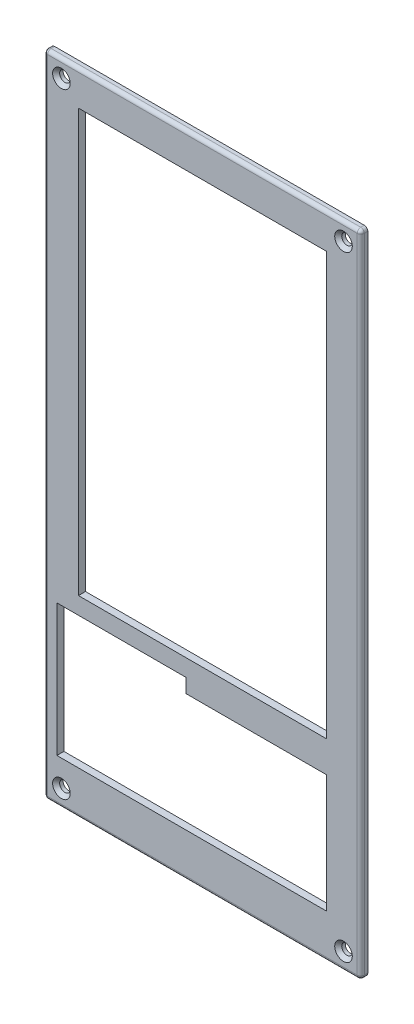
ISO-10303-21;
HEADER;
FILE_DESCRIPTION(('STEP AP214'),'2;1');
FILE_NAME('part.step','',(''),(''),'','','');
FILE_SCHEMA(('AUTOMOTIVE_DESIGN { 1 0 10303 214 1 1 1 1 }'));
ENDSEC;
DATA;
#1=APPLICATION_CONTEXT('core data for automotive mechanical design processes');
#2=APPLICATION_PROTOCOL_DEFINITION('international standard','automotive_design',2000,#1);
#3=PRODUCT_CONTEXT('',#1,'mechanical');
#4=PRODUCT('Part','Part','',(#3));
#5=PRODUCT_RELATED_PRODUCT_CATEGORY('part','',(#4));
#6=PRODUCT_DEFINITION_FORMATION('','',#4);
#7=PRODUCT_DEFINITION_CONTEXT('part definition',#1,'design');
#8=PRODUCT_DEFINITION('design','',#6,#7);
#9=PRODUCT_DEFINITION_SHAPE('','',#8);
#10=(LENGTH_UNIT() NAMED_UNIT(*) SI_UNIT(.MILLI.,.METRE.));
#11=(NAMED_UNIT(*) PLANE_ANGLE_UNIT() SI_UNIT($,.RADIAN.));
#12=(NAMED_UNIT(*) SI_UNIT($,.STERADIAN.) SOLID_ANGLE_UNIT());
#13=UNCERTAINTY_MEASURE_WITH_UNIT(LENGTH_MEASURE(1.E-05),#10,'distance_accuracy_value','');
#14=(GEOMETRIC_REPRESENTATION_CONTEXT(3) GLOBAL_UNCERTAINTY_ASSIGNED_CONTEXT((#13)) GLOBAL_UNIT_ASSIGNED_CONTEXT((#10,
#11,#12)) REPRESENTATION_CONTEXT('',''));
#15=CARTESIAN_POINT('',(0.,0.,0.));
#16=DIRECTION('',(0.,0.,1.));
#17=DIRECTION('',(1.,0.,0.));
#18=AXIS2_PLACEMENT_3D('',#15,#16,#17);
#19=CARTESIAN_POINT('',(0.,-183.6,1.));
#20=DIRECTION('',(-1.,0.,0.));
#21=DIRECTION('',(0.,0.,1.));
#22=AXIS2_PLACEMENT_3D('',#19,#20,#21);
#23=CYLINDRICAL_SURFACE('',#22,1.);
#24=CARTESIAN_POINT('',(89.,-183.6,1.));
#25=DIRECTION('',(1.,0.,0.));
#26=DIRECTION('',(0.,0.,-1.));
#27=AXIS2_PLACEMENT_3D('',#24,#25,#26);
#28=CIRCLE('',#27,1.);
#29=CARTESIAN_POINT('',(89.,-183.6,2.));
#30=VERTEX_POINT('',#29);
#31=CARTESIAN_POINT('',(89.,-184.6,1.));
#32=VERTEX_POINT('',#31);
#33=EDGE_CURVE('E11',#30,#32,#28,.T.);
#34=ORIENTED_EDGE('',*,*,#33,.F.);
#35=DIRECTION('',(1.,0.,0.));
#36=VECTOR('',#35,1.);
#37=CARTESIAN_POINT('',(0.,-183.6,2.));
#38=LINE('',#37,#36);
#39=CARTESIAN_POINT('',(1.00000000000003,-183.6,2.));
#40=VERTEX_POINT('',#39);
#41=EDGE_CURVE('E403',#40,#30,#38,.T.);
#42=ORIENTED_EDGE('',*,*,#41,.F.);
#43=CARTESIAN_POINT('',(1.00000000000002,-183.6,1.));
#44=DIRECTION('',(1.,0.,0.));
#45=DIRECTION('',(0.,1.,0.));
#46=AXIS2_PLACEMENT_3D('',#43,#44,#45);
#47=CIRCLE('',#46,1.);
#48=CARTESIAN_POINT('',(1.00000000000003,-184.6,1.));
#49=VERTEX_POINT('',#48);
#50=EDGE_CURVE('E59',#40,#49,#47,.T.);
#51=ORIENTED_EDGE('',*,*,#50,.T.);
#52=DIRECTION('',(1.,0.,0.));
#53=VECTOR('',#52,1.);
#54=CARTESIAN_POINT('',(0.,-184.6,1.));
#55=LINE('',#54,#53);
#56=EDGE_CURVE('E442',#32,#49,#55,.F.);
#57=ORIENTED_EDGE('',*,*,#56,.F.);
#58=EDGE_LOOP('',(#34,#42,#51,#57));
#59=FACE_BOUND('',#58,.T.);
#60=ADVANCED_FACE('F51',(#59),#23,.T.);
#61=CARTESIAN_POINT('',(1.00000000000002,-183.6,1.));
#62=DIRECTION('',(0.,0.,1.));
#63=DIRECTION('',(1.,0.,0.));
#64=AXIS2_PLACEMENT_3D('',#61,#62,#63);
#65=SPHERICAL_SURFACE('',#64,1.);
#66=ORIENTED_EDGE('',*,*,#50,.F.);
#67=CARTESIAN_POINT('',(1.00000000000002,-183.6,1.));
#68=DIRECTION('',(0.,-1.,0.));
#69=DIRECTION('',(0.,0.,-1.));
#70=AXIS2_PLACEMENT_3D('',#67,#68,#69);
#71=CIRCLE('',#70,1.);
#72=CARTESIAN_POINT('',(0.,-183.6,1.));
#73=VERTEX_POINT('',#72);
#74=EDGE_CURVE('E72',#40,#73,#71,.T.);
#75=ORIENTED_EDGE('',*,*,#74,.T.);
#76=CARTESIAN_POINT('',(1.00000000000002,-183.6,1.));
#77=DIRECTION('',(0.,0.,-1.));
#78=DIRECTION('',(-1.,0.,0.));
#79=AXIS2_PLACEMENT_3D('',#76,#77,#78);
#80=CIRCLE('',#79,1.);
#81=EDGE_CURVE('E439',#49,#73,#80,.T.);
#82=ORIENTED_EDGE('',*,*,#81,.F.);
#83=EDGE_LOOP('',(#66,#75,#82));
#84=FACE_BOUND('',#83,.T.);
#85=ADVANCED_FACE('F516',(#84),#65,.T.);
#86=CARTESIAN_POINT('',(1.,0.,1.));
#87=DIRECTION('',(0.,1.,0.));
#88=DIRECTION('',(-1.,0.,0.));
#89=AXIS2_PLACEMENT_3D('',#86,#87,#88);
#90=CYLINDRICAL_SURFACE('',#89,1.);
#91=ORIENTED_EDGE('',*,*,#74,.F.);
#92=DIRECTION('',(0.,-1.,0.));
#93=VECTOR('',#92,1.);
#94=CARTESIAN_POINT('',(1.,0.,2.));
#95=LINE('',#94,#93);
#96=CARTESIAN_POINT('',(1.,-1.00000000000001,2.));
#97=VERTEX_POINT('',#96);
#98=EDGE_CURVE('E407',#97,#40,#95,.T.);
#99=ORIENTED_EDGE('',*,*,#98,.F.);
#100=CARTESIAN_POINT('',(1.,-1.,1.));
#101=DIRECTION('',(0.,-1.,0.));
#102=DIRECTION('',(1.,0.,0.));
#103=AXIS2_PLACEMENT_3D('',#100,#101,#102);
#104=CIRCLE('',#103,1.);
#105=CARTESIAN_POINT('',(0.,-1.00000000000001,1.));
#106=VERTEX_POINT('',#105);
#107=EDGE_CURVE('E457',#97,#106,#104,.T.);
#108=ORIENTED_EDGE('',*,*,#107,.T.);
#109=DIRECTION('',(0.,-1.,0.));
#110=VECTOR('',#109,1.);
#111=CARTESIAN_POINT('',(0.,0.,1.));
#112=LINE('',#111,#110);
#113=EDGE_CURVE('E435',#73,#106,#112,.F.);
#114=ORIENTED_EDGE('',*,*,#113,.F.);
#115=EDGE_LOOP('',(#91,#99,#108,#114));
#116=FACE_BOUND('',#115,.T.);
#117=ADVANCED_FACE('F521',(#116),#90,.T.);
#118=CARTESIAN_POINT('',(1.,-1.,1.));
#119=DIRECTION('',(0.,0.,1.));
#120=DIRECTION('',(1.,0.,0.));
#121=AXIS2_PLACEMENT_3D('',#118,#119,#120);
#122=SPHERICAL_SURFACE('',#121,1.);
#123=ORIENTED_EDGE('',*,*,#107,.F.);
#124=CARTESIAN_POINT('',(1.00000000000001,-1.,1.));
#125=DIRECTION('',(-1.,0.,0.));
#126=DIRECTION('',(0.,0.,1.));
#127=AXIS2_PLACEMENT_3D('',#124,#125,#126);
#128=CIRCLE('',#127,1.);
#129=CARTESIAN_POINT('',(1.00000000000001,0.,1.));
#130=VERTEX_POINT('',#129);
#131=EDGE_CURVE('E454',#97,#130,#128,.T.);
#132=ORIENTED_EDGE('',*,*,#131,.T.);
#133=CARTESIAN_POINT('',(1.,-1.,1.));
#134=DIRECTION('',(0.,0.,-1.));
#135=DIRECTION('',(-1.,0.,0.));
#136=AXIS2_PLACEMENT_3D('',#133,#134,#135);
#137=CIRCLE('',#136,1.);
#138=EDGE_CURVE('E431',#106,#130,#137,.T.);
#139=ORIENTED_EDGE('',*,*,#138,.F.);
#140=EDGE_LOOP('',(#123,#132,#139));
#141=FACE_BOUND('',#140,.T.);
#142=ADVANCED_FACE('F573',(#141),#122,.T.);
#143=CARTESIAN_POINT('',(0.,-1.,1.));
#144=DIRECTION('',(1.,0.,0.));
#145=DIRECTION('',(0.,0.,-1.));
#146=AXIS2_PLACEMENT_3D('',#143,#144,#145);
#147=CYLINDRICAL_SURFACE('',#146,1.);
#148=ORIENTED_EDGE('',*,*,#131,.F.);
#149=DIRECTION('',(-1.,0.,0.));
#150=VECTOR('',#149,1.);
#151=CARTESIAN_POINT('',(0.,-1.,2.));
#152=LINE('',#151,#150);
#153=CARTESIAN_POINT('',(89.,-1.,2.));
#154=VERTEX_POINT('',#153);
#155=EDGE_CURVE('E411',#154,#97,#152,.T.);
#156=ORIENTED_EDGE('',*,*,#155,.F.);
#157=CARTESIAN_POINT('',(89.,-1.,1.));
#158=DIRECTION('',(-1.,0.,0.));
#159=DIRECTION('',(0.,0.,1.));
#160=AXIS2_PLACEMENT_3D('',#157,#158,#159);
#161=CIRCLE('',#160,1.);
#162=CARTESIAN_POINT('',(89.,0.,1.));
#163=VERTEX_POINT('',#162);
#164=EDGE_CURVE('E451',#154,#163,#161,.T.);
#165=ORIENTED_EDGE('',*,*,#164,.T.);
#166=DIRECTION('',(-1.,0.,0.));
#167=VECTOR('',#166,1.);
#168=CARTESIAN_POINT('',(0.,0.,1.));
#169=LINE('',#168,#167);
#170=EDGE_CURVE('E427',#130,#163,#169,.F.);
#171=ORIENTED_EDGE('',*,*,#170,.F.);
#172=EDGE_LOOP('',(#148,#156,#165,#171));
#173=FACE_BOUND('',#172,.T.);
#174=ADVANCED_FACE('F565',(#173),#147,.T.);
#175=CARTESIAN_POINT('',(89.,-1.,1.));
#176=DIRECTION('',(0.,0.,1.));
#177=DIRECTION('',(1.,0.,0.));
#178=AXIS2_PLACEMENT_3D('',#175,#176,#177);
#179=SPHERICAL_SURFACE('',#178,1.);
#180=ORIENTED_EDGE('',*,*,#164,.F.);
#181=CARTESIAN_POINT('',(89.,-1.00000000000001,1.));
#182=DIRECTION('',(0.,1.,0.));
#183=DIRECTION('',(0.,0.,1.));
#184=AXIS2_PLACEMENT_3D('',#181,#182,#183);
#185=CIRCLE('',#184,1.);
#186=CARTESIAN_POINT('',(90.,-1.00000000000001,1.));
#187=VERTEX_POINT('',#186);
#188=EDGE_CURVE('E448',#154,#187,#185,.T.);
#189=ORIENTED_EDGE('',*,*,#188,.T.);
#190=CARTESIAN_POINT('',(89.,-1.,1.));
#191=DIRECTION('',(0.,0.,-1.));
#192=DIRECTION('',(-1.,0.,0.));
#193=AXIS2_PLACEMENT_3D('',#190,#191,#192);
#194=CIRCLE('',#193,1.);
#195=EDGE_CURVE('E423',#163,#187,#194,.T.);
#196=ORIENTED_EDGE('',*,*,#195,.F.);
#197=EDGE_LOOP('',(#180,#189,#196));
#198=FACE_BOUND('',#197,.T.);
#199=ADVANCED_FACE('F561',(#198),#179,.T.);
#200=CARTESIAN_POINT('',(89.,0.,1.));
#201=DIRECTION('',(0.,-1.,0.));
#202=DIRECTION('',(0.,0.,-1.));
#203=AXIS2_PLACEMENT_3D('',#200,#201,#202);
#204=CYLINDRICAL_SURFACE('',#203,1.);
#205=ORIENTED_EDGE('',*,*,#188,.F.);
#206=DIRECTION('',(0.,1.,0.));
#207=VECTOR('',#206,1.);
#208=CARTESIAN_POINT('',(89.,0.,2.));
#209=LINE('',#208,#207);
#210=EDGE_CURVE('E415',#30,#154,#209,.T.);
#211=ORIENTED_EDGE('',*,*,#210,.F.);
#212=CARTESIAN_POINT('',(89.,-183.6,1.));
#213=DIRECTION('',(0.,1.,0.));
#214=DIRECTION('',(0.,0.,1.));
#215=AXIS2_PLACEMENT_3D('',#212,#213,#214);
#216=CIRCLE('',#215,1.);
#217=CARTESIAN_POINT('',(90.,-183.6,1.));
#218=VERTEX_POINT('',#217);
#219=EDGE_CURVE('E445',#30,#218,#216,.T.);
#220=ORIENTED_EDGE('',*,*,#219,.T.);
#221=DIRECTION('',(0.,1.,0.));
#222=VECTOR('',#221,1.);
#223=CARTESIAN_POINT('',(90.,0.,1.));
#224=LINE('',#223,#222);
#225=EDGE_CURVE('E419',#187,#218,#224,.F.);
#226=ORIENTED_EDGE('',*,*,#225,.F.);
#227=EDGE_LOOP('',(#205,#211,#220,#226));
#228=FACE_BOUND('',#227,.T.);
#229=ADVANCED_FACE('F531',(#228),#204,.T.);
#230=CARTESIAN_POINT('',(89.,-183.6,1.));
#231=DIRECTION('',(0.,0.,1.));
#232=DIRECTION('',(1.,0.,0.));
#233=AXIS2_PLACEMENT_3D('',#230,#231,#232);
#234=SPHERICAL_SURFACE('',#233,1.);
#235=ORIENTED_EDGE('',*,*,#219,.F.);
#236=ORIENTED_EDGE('',*,*,#33,.T.);
#237=CARTESIAN_POINT('',(89.,-183.6,1.));
#238=DIRECTION('',(0.,0.,-1.));
#239=DIRECTION('',(-1.,0.,0.));
#240=AXIS2_PLACEMENT_3D('',#237,#238,#239);
#241=CIRCLE('',#240,1.);
#242=EDGE_CURVE('E399',#218,#32,#241,.T.);
#243=ORIENTED_EDGE('',*,*,#242,.F.);
#244=EDGE_LOOP('',(#235,#236,#243));
#245=FACE_BOUND('',#244,.T.);
#246=ADVANCED_FACE('F526',(#245),#234,.T.);
#247=CARTESIAN_POINT('',(0.,0.,2.));
#248=DIRECTION('',(1.,0.,0.));
#249=DIRECTION('',(0.,1.,0.));
#250=AXIS2_PLACEMENT_3D('',#247,#248,#249);
#251=PLANE('',#250);
#252=DIRECTION('',(0.,0.,-1.));
#253=VECTOR('',#252,1.);
#254=CARTESIAN_POINT('',(0.,-183.6,2.));
#255=LINE('',#254,#253);
#256=CARTESIAN_POINT('',(0.,-183.6,0.));
#257=VERTEX_POINT('',#256);
#258=EDGE_CURVE('E364',#73,#257,#255,.T.);
#259=ORIENTED_EDGE('',*,*,#258,.F.);
#260=ORIENTED_EDGE('',*,*,#113,.T.);
#261=DIRECTION('',(0.,0.,-1.));
#262=VECTOR('',#261,1.);
#263=CARTESIAN_POINT('',(0.,-1.00000000000001,2.));
#264=LINE('',#263,#262);
#265=CARTESIAN_POINT('',(0.,-1.00000000000001,0.));
#266=VERTEX_POINT('',#265);
#267=EDGE_CURVE('E343',#106,#266,#264,.T.);
#268=ORIENTED_EDGE('',*,*,#267,.T.);
#269=DIRECTION('',(0.,-1.,0.));
#270=VECTOR('',#269,1.);
#271=CARTESIAN_POINT('',(0.,0.,0.));
#272=LINE('',#271,#270);
#273=EDGE_CURVE('E307',#266,#257,#272,.T.);
#274=ORIENTED_EDGE('',*,*,#273,.T.);
#275=EDGE_LOOP('',(#259,#260,#268,#274));
#276=FACE_BOUND('',#275,.T.);
#277=ADVANCED_FACE('F539',(#276),#251,.F.);
#278=CARTESIAN_POINT('',(1.00000000000002,-183.6,2.));
#279=DIRECTION('',(0.,0.,-1.));
#280=DIRECTION('',(-1.,0.,0.));
#281=AXIS2_PLACEMENT_3D('',#278,#279,#280);
#282=CYLINDRICAL_SURFACE('',#281,1.);
#283=DIRECTION('',(0.,0.,-1.));
#284=VECTOR('',#283,1.);
#285=CARTESIAN_POINT('',(1.00000000000003,-184.6,2.));
#286=LINE('',#285,#284);
#287=CARTESIAN_POINT('',(1.00000000000003,-184.6,0.));
#288=VERTEX_POINT('',#287);
#289=EDGE_CURVE('E361',#49,#288,#286,.T.);
#290=ORIENTED_EDGE('',*,*,#289,.F.);
#291=ORIENTED_EDGE('',*,*,#81,.T.);
#292=ORIENTED_EDGE('',*,*,#258,.T.);
#293=CARTESIAN_POINT('',(1.00000000000002,-183.6,0.));
#294=DIRECTION('',(0.,0.,1.));
#295=DIRECTION('',(1.,0.,0.));
#296=AXIS2_PLACEMENT_3D('',#293,#294,#295);
#297=CIRCLE('',#296,1.);
#298=EDGE_CURVE('E311',#257,#288,#297,.T.);
#299=ORIENTED_EDGE('',*,*,#298,.T.);
#300=EDGE_LOOP('',(#290,#291,#292,#299));
#301=FACE_BOUND('',#300,.T.);
#302=ADVANCED_FACE('F542',(#301),#282,.T.);
#303=CARTESIAN_POINT('',(0.,-184.6,2.));
#304=DIRECTION('',(0.,1.,0.));
#305=DIRECTION('',(0.,0.,1.));
#306=AXIS2_PLACEMENT_3D('',#303,#304,#305);
#307=PLANE('',#306);
#308=DIRECTION('',(0.,0.,-1.));
#309=VECTOR('',#308,1.);
#310=CARTESIAN_POINT('',(89.,-184.6,2.));
#311=LINE('',#310,#309);
#312=CARTESIAN_POINT('',(89.,-184.6,0.));
#313=VERTEX_POINT('',#312);
#314=EDGE_CURVE('E358',#32,#313,#311,.T.);
#315=ORIENTED_EDGE('',*,*,#314,.F.);
#316=ORIENTED_EDGE('',*,*,#56,.T.);
#317=ORIENTED_EDGE('',*,*,#289,.T.);
#318=DIRECTION('',(1.,0.,0.));
#319=VECTOR('',#318,1.);
#320=CARTESIAN_POINT('',(0.,-184.6,0.));
#321=LINE('',#320,#319);
#322=EDGE_CURVE('E315',#288,#313,#321,.T.);
#323=ORIENTED_EDGE('',*,*,#322,.T.);
#324=EDGE_LOOP('',(#315,#316,#317,#323));
#325=FACE_BOUND('',#324,.T.);
#326=ADVANCED_FACE('F548',(#325),#307,.F.);
#327=CARTESIAN_POINT('',(89.,-183.6,2.));
#328=DIRECTION('',(0.,0.,-1.));
#329=DIRECTION('',(-1.,0.,0.));
#330=AXIS2_PLACEMENT_3D('',#327,#328,#329);
#331=CYLINDRICAL_SURFACE('',#330,1.);
#332=DIRECTION('',(0.,0.,-1.));
#333=VECTOR('',#332,1.);
#334=CARTESIAN_POINT('',(90.,-183.6,2.));
#335=LINE('',#334,#333);
#336=CARTESIAN_POINT('',(90.,-183.6,0.));
#337=VERTEX_POINT('',#336);
#338=EDGE_CURVE('E355',#218,#337,#335,.T.);
#339=ORIENTED_EDGE('',*,*,#338,.F.);
#340=ORIENTED_EDGE('',*,*,#242,.T.);
#341=ORIENTED_EDGE('',*,*,#314,.T.);
#342=CARTESIAN_POINT('',(89.,-183.6,0.));
#343=DIRECTION('',(0.,0.,1.));
#344=DIRECTION('',(1.,0.,0.));
#345=AXIS2_PLACEMENT_3D('',#342,#343,#344);
#346=CIRCLE('',#345,1.);
#347=EDGE_CURVE('E319',#313,#337,#346,.T.);
#348=ORIENTED_EDGE('',*,*,#347,.T.);
#349=EDGE_LOOP('',(#339,#340,#341,#348));
#350=FACE_BOUND('',#349,.T.);
#351=ADVANCED_FACE('F550',(#350),#331,.T.);
#352=CARTESIAN_POINT('',(90.,0.,2.));
#353=DIRECTION('',(-1.,0.,0.));
#354=DIRECTION('',(0.,0.,1.));
#355=AXIS2_PLACEMENT_3D('',#352,#353,#354);
#356=PLANE('',#355);
#357=DIRECTION('',(0.,0.,-1.));
#358=VECTOR('',#357,1.);
#359=CARTESIAN_POINT('',(90.,-1.00000000000001,2.));
#360=LINE('',#359,#358);
#361=CARTESIAN_POINT('',(90.,-1.00000000000001,0.));
#362=VERTEX_POINT('',#361);
#363=EDGE_CURVE('E352',#187,#362,#360,.T.);
#364=ORIENTED_EDGE('',*,*,#363,.F.);
#365=ORIENTED_EDGE('',*,*,#225,.T.);
#366=ORIENTED_EDGE('',*,*,#338,.T.);
#367=DIRECTION('',(0.,1.,0.));
#368=VECTOR('',#367,1.);
#369=CARTESIAN_POINT('',(90.,0.,0.));
#370=LINE('',#369,#368);
#371=EDGE_CURVE('E323',#337,#362,#370,.T.);
#372=ORIENTED_EDGE('',*,*,#371,.T.);
#373=EDGE_LOOP('',(#364,#365,#366,#372));
#374=FACE_BOUND('',#373,.T.);
#375=ADVANCED_FACE('F553',(#374),#356,.F.);
#376=CARTESIAN_POINT('',(89.,-1.,2.));
#377=DIRECTION('',(0.,0.,-1.));
#378=DIRECTION('',(-1.,0.,0.));
#379=AXIS2_PLACEMENT_3D('',#376,#377,#378);
#380=CYLINDRICAL_SURFACE('',#379,1.);
#381=DIRECTION('',(0.,0.,-1.));
#382=VECTOR('',#381,1.);
#383=CARTESIAN_POINT('',(89.,0.,2.));
#384=LINE('',#383,#382);
#385=CARTESIAN_POINT('',(89.,0.,0.));
#386=VERTEX_POINT('',#385);
#387=EDGE_CURVE('E349',#163,#386,#384,.T.);
#388=ORIENTED_EDGE('',*,*,#387,.F.);
#389=ORIENTED_EDGE('',*,*,#195,.T.);
#390=ORIENTED_EDGE('',*,*,#363,.T.);
#391=CARTESIAN_POINT('',(89.,-1.,0.));
#392=DIRECTION('',(0.,0.,1.));
#393=DIRECTION('',(1.,0.,0.));
#394=AXIS2_PLACEMENT_3D('',#391,#392,#393);
#395=CIRCLE('',#394,1.);
#396=EDGE_CURVE('E327',#362,#386,#395,.T.);
#397=ORIENTED_EDGE('',*,*,#396,.T.);
#398=EDGE_LOOP('',(#388,#389,#390,#397));
#399=FACE_BOUND('',#398,.T.);
#400=ADVANCED_FACE('F557',(#399),#380,.T.);
#401=CARTESIAN_POINT('',(0.,0.,2.));
#402=DIRECTION('',(0.,-1.,0.));
#403=DIRECTION('',(0.,0.,-1.));
#404=AXIS2_PLACEMENT_3D('',#401,#402,#403);
#405=PLANE('',#404);
#406=DIRECTION('',(0.,0.,-1.));
#407=VECTOR('',#406,1.);
#408=CARTESIAN_POINT('',(1.00000000000001,0.,2.));
#409=LINE('',#408,#407);
#410=CARTESIAN_POINT('',(1.00000000000001,0.,0.));
#411=VERTEX_POINT('',#410);
#412=EDGE_CURVE('E346',#130,#411,#409,.T.);
#413=ORIENTED_EDGE('',*,*,#412,.F.);
#414=ORIENTED_EDGE('',*,*,#170,.T.);
#415=ORIENTED_EDGE('',*,*,#387,.T.);
#416=DIRECTION('',(-1.,0.,0.));
#417=VECTOR('',#416,1.);
#418=CARTESIAN_POINT('',(0.,0.,0.));
#419=LINE('',#418,#417);
#420=EDGE_CURVE('E331',#386,#411,#419,.T.);
#421=ORIENTED_EDGE('',*,*,#420,.T.);
#422=EDGE_LOOP('',(#413,#414,#415,#421));
#423=FACE_BOUND('',#422,.T.);
#424=ADVANCED_FACE('F568',(#423),#405,.F.);
#425=CARTESIAN_POINT('',(1.,-1.,2.));
#426=DIRECTION('',(0.,0.,-1.));
#427=DIRECTION('',(-1.,0.,0.));
#428=AXIS2_PLACEMENT_3D('',#425,#426,#427);
#429=CYLINDRICAL_SURFACE('',#428,1.);
#430=ORIENTED_EDGE('',*,*,#267,.F.);
#431=ORIENTED_EDGE('',*,*,#138,.T.);
#432=ORIENTED_EDGE('',*,*,#412,.T.);
#433=CARTESIAN_POINT('',(1.,-1.,0.));
#434=DIRECTION('',(0.,0.,1.));
#435=DIRECTION('',(1.,0.,0.));
#436=AXIS2_PLACEMENT_3D('',#433,#434,#435);
#437=CIRCLE('',#436,1.);
#438=EDGE_CURVE('E335',#266,#411,#437,.F.);
#439=ORIENTED_EDGE('',*,*,#438,.F.);
#440=EDGE_LOOP('',(#430,#431,#432,#439));
#441=FACE_BOUND('',#440,.T.);
#442=ADVANCED_FACE('F571',(#441),#429,.T.);
#443=CARTESIAN_POINT('',(4.90640059568512,-179.693599404313,2.));
#444=DIRECTION('',(0.,0.,-1.));
#445=DIRECTION('',(-1.,0.,0.));
#446=AXIS2_PLACEMENT_3D('',#443,#444,#445);
#447=CYLINDRICAL_SURFACE('',#446,1.5);
#448=CARTESIAN_POINT('',(4.90640059568512,-179.693599404313,1.00000000000002));
#449=DIRECTION('',(0.,0.,1.));
#450=DIRECTION('',(1.,0.,0.));
#451=AXIS2_PLACEMENT_3D('',#448,#449,#450);
#452=CIRCLE('',#451,1.5);
#453=CARTESIAN_POINT('',(6.40640059568511,-179.693599404313,1.00000000000002));
#454=VERTEX_POINT('',#453);
#455=EDGE_CURVE('E391',#454,#454,#452,.T.);
#456=ORIENTED_EDGE('',*,*,#455,.T.);
#457=EDGE_LOOP('',(#456));
#458=FACE_BOUND('',#457,.T.);
#459=CARTESIAN_POINT('',(4.90640059568512,-179.693599404313,0.));
#460=DIRECTION('',(0.,0.,1.));
#461=DIRECTION('',(1.,0.,0.));
#462=AXIS2_PLACEMENT_3D('',#459,#460,#461);
#463=CIRCLE('',#462,1.5);
#464=CARTESIAN_POINT('',(6.40640059568511,-179.693599404313,0.));
#465=VERTEX_POINT('',#464);
#466=EDGE_CURVE('E303',#465,#465,#463,.T.);
#467=ORIENTED_EDGE('',*,*,#466,.F.);
#468=EDGE_LOOP('',(#467));
#469=FACE_BOUND('',#468,.T.);
#470=ADVANCED_FACE('F618',(#458,#469),#447,.F.);
#471=CARTESIAN_POINT('',(4.90640059568512,-4.90640059568656,2.));
#472=DIRECTION('',(0.,0.,-1.));
#473=DIRECTION('',(-1.,0.,0.));
#474=AXIS2_PLACEMENT_3D('',#471,#472,#473);
#475=CYLINDRICAL_SURFACE('',#474,1.5);
#476=CARTESIAN_POINT('',(4.90640059568512,-4.90640059568656,0.999999999999982));
#477=DIRECTION('',(0.,0.,1.));
#478=DIRECTION('',(1.,0.,0.));
#479=AXIS2_PLACEMENT_3D('',#476,#477,#478);
#480=CIRCLE('',#479,1.5);
#481=CARTESIAN_POINT('',(6.40640059568511,-4.90640059568656,0.999999999999982));
#482=VERTEX_POINT('',#481);
#483=EDGE_CURVE('E395',#482,#482,#480,.T.);
#484=ORIENTED_EDGE('',*,*,#483,.T.);
#485=EDGE_LOOP('',(#484));
#486=FACE_BOUND('',#485,.T.);
#487=CARTESIAN_POINT('',(4.90640059568512,-4.90640059568656,0.));
#488=DIRECTION('',(0.,0.,1.));
#489=DIRECTION('',(1.,0.,0.));
#490=AXIS2_PLACEMENT_3D('',#487,#488,#489);
#491=CIRCLE('',#490,1.5);
#492=CARTESIAN_POINT('',(6.40640059568511,-4.90640059568656,0.));
#493=VERTEX_POINT('',#492);
#494=EDGE_CURVE('E299',#493,#493,#491,.F.);
#495=ORIENTED_EDGE('',*,*,#494,.T.);
#496=EDGE_LOOP('',(#495));
#497=FACE_BOUND('',#496,.T.);
#498=ADVANCED_FACE('F511',(#486,#497),#475,.F.);
#499=CARTESIAN_POINT('',(85.0935994043149,-4.90640059568662,2.));
#500=DIRECTION('',(0.,0.,-1.));
#501=DIRECTION('',(-1.,0.,0.));
#502=AXIS2_PLACEMENT_3D('',#499,#500,#501);
#503=CYLINDRICAL_SURFACE('',#502,1.5);
#504=CARTESIAN_POINT('',(85.0935994043149,-4.90640059568662,0.99999999999999));
#505=DIRECTION('',(0.,0.,1.));
#506=DIRECTION('',(1.,0.,0.));
#507=AXIS2_PLACEMENT_3D('',#504,#505,#506);
#508=CIRCLE('',#507,1.5);
#509=CARTESIAN_POINT('',(86.5935994043149,-4.90640059568662,0.99999999999999));
#510=VERTEX_POINT('',#509);
#511=EDGE_CURVE('E367',#510,#510,#508,.T.);
#512=ORIENTED_EDGE('',*,*,#511,.T.);
#513=EDGE_LOOP('',(#512));
#514=FACE_BOUND('',#513,.T.);
#515=CARTESIAN_POINT('',(85.0935994043149,-4.90640059568662,0.));
#516=DIRECTION('',(0.,0.,1.));
#517=DIRECTION('',(1.,0.,0.));
#518=AXIS2_PLACEMENT_3D('',#515,#516,#517);
#519=CIRCLE('',#518,1.5);
#520=CARTESIAN_POINT('',(86.5935994043149,-4.90640059568662,0.));
#521=VERTEX_POINT('',#520);
#522=EDGE_CURVE('E233',#521,#521,#519,.T.);
#523=ORIENTED_EDGE('',*,*,#522,.F.);
#524=EDGE_LOOP('',(#523));
#525=FACE_BOUND('',#524,.T.);
#526=ADVANCED_FACE('F501',(#514,#525),#503,.F.);
#527=CARTESIAN_POINT('',(85.0935994043149,-179.693599404313,2.));
#528=DIRECTION('',(0.,0.,-1.));
#529=DIRECTION('',(-1.,0.,0.));
#530=AXIS2_PLACEMENT_3D('',#527,#528,#529);
#531=CYLINDRICAL_SURFACE('',#530,1.5);
#532=CARTESIAN_POINT('',(85.0935994043149,-179.693599404313,0.99999999999999));
#533=DIRECTION('',(0.,0.,1.));
#534=DIRECTION('',(1.,0.,0.));
#535=AXIS2_PLACEMENT_3D('',#532,#533,#534);
#536=CIRCLE('',#535,1.5);
#537=CARTESIAN_POINT('',(86.5935994043149,-179.693599404313,0.99999999999999));
#538=VERTEX_POINT('',#537);
#539=EDGE_CURVE('E387',#538,#538,#536,.T.);
#540=ORIENTED_EDGE('',*,*,#539,.T.);
#541=EDGE_LOOP('',(#540));
#542=FACE_BOUND('',#541,.T.);
#543=CARTESIAN_POINT('',(85.0935994043149,-179.693599404313,0.));
#544=DIRECTION('',(0.,0.,1.));
#545=DIRECTION('',(1.,0.,0.));
#546=AXIS2_PLACEMENT_3D('',#543,#544,#545);
#547=CIRCLE('',#546,1.5);
#548=CARTESIAN_POINT('',(86.5935994043149,-179.693599404313,0.));
#549=VERTEX_POINT('',#548);
#550=EDGE_CURVE('E339',#549,#549,#547,.F.);
#551=ORIENTED_EDGE('',*,*,#550,.T.);
#552=EDGE_LOOP('',(#551));
#553=FACE_BOUND('',#552,.T.);
#554=ADVANCED_FACE('F499',(#542,#553),#531,.F.);
#555=CARTESIAN_POINT('',(0.,0.,2.));
#556=DIRECTION('',(0.,0.,1.));
#557=DIRECTION('',(1.,0.,0.));
#558=AXIS2_PLACEMENT_3D('',#555,#556,#557);
#559=PLANE('',#558);
#560=ORIENTED_EDGE('',*,*,#41,.T.);
#561=ORIENTED_EDGE('',*,*,#210,.T.);
#562=ORIENTED_EDGE('',*,*,#155,.T.);
#563=ORIENTED_EDGE('',*,*,#98,.T.);
#564=EDGE_LOOP('',(#560,#561,#562,#563));
#565=FACE_BOUND('',#564,.T.);
#566=DIRECTION('',(0.,-1.,0.));
#567=VECTOR('',#566,1.);
#568=CARTESIAN_POINT('',(9.75774957468557,-9.79836629832936,2.));
#569=LINE('',#568,#567);
#570=CARTESIAN_POINT('',(9.75774957468557,-9.79836629832936,2.));
#571=VERTEX_POINT('',#570);
#572=CARTESIAN_POINT('',(9.75774957468558,-129.798366298329,2.));
#573=VERTEX_POINT('',#572);
#574=EDGE_CURVE('E211',#571,#573,#569,.T.);
#575=ORIENTED_EDGE('',*,*,#574,.F.);
#576=DIRECTION('',(-1.,0.,0.));
#577=VECTOR('',#576,1.);
#578=CARTESIAN_POINT('',(9.75774957468557,-9.79836629832936,2.));
#579=LINE('',#578,#577);
#580=CARTESIAN_POINT('',(80.2422504253145,-9.79836629832936,2.));
#581=VERTEX_POINT('',#580);
#582=EDGE_CURVE('E216',#581,#571,#579,.T.);
#583=ORIENTED_EDGE('',*,*,#582,.F.);
#584=DIRECTION('',(0.,1.,0.));
#585=VECTOR('',#584,1.);
#586=CARTESIAN_POINT('',(80.2422504253145,-9.79836629832936,2.));
#587=LINE('',#586,#585);
#588=CARTESIAN_POINT('',(80.2422504253145,-129.798366298329,2.));
#589=VERTEX_POINT('',#588);
#590=EDGE_CURVE('E193',#589,#581,#587,.T.);
#591=ORIENTED_EDGE('',*,*,#590,.F.);
#592=DIRECTION('',(1.,0.,0.));
#593=VECTOR('',#592,1.);
#594=CARTESIAN_POINT('',(80.2422504253145,-129.798366298329,2.));
#595=LINE('',#594,#593);
#596=EDGE_CURVE('E205',#573,#589,#595,.T.);
#597=ORIENTED_EDGE('',*,*,#596,.F.);
#598=EDGE_LOOP('',(#575,#583,#591,#597));
#599=FACE_BOUND('',#598,.T.);
#600=DIRECTION('',(0.,1.,0.));
#601=VECTOR('',#600,1.);
#602=CARTESIAN_POINT('',(80.2422504253145,-172.224363873103,2.));
#603=LINE('',#602,#601);
#604=CARTESIAN_POINT('',(80.2422504253145,-172.224363873103,2.));
#605=VERTEX_POINT('',#604);
#606=CARTESIAN_POINT('',(80.2422504253145,-138.653704662281,2.));
#607=VERTEX_POINT('',#606);
#608=EDGE_CURVE('E279',#605,#607,#603,.T.);
#609=ORIENTED_EDGE('',*,*,#608,.F.);
#610=DIRECTION('',(1.,0.,0.));
#611=VECTOR('',#610,1.);
#612=CARTESIAN_POINT('',(3.61620761531452,-172.224363873103,2.));
#613=LINE('',#612,#611);
#614=CARTESIAN_POINT('',(3.61620761531452,-172.224363873103,2.));
#615=VERTEX_POINT('',#614);
#616=EDGE_CURVE('E243',#615,#605,#613,.T.);
#617=ORIENTED_EDGE('',*,*,#616,.F.);
#618=DIRECTION('',(0.,-1.,0.));
#619=VECTOR('',#618,1.);
#620=CARTESIAN_POINT('',(3.61620761531452,-134.653704662281,2.));
#621=LINE('',#620,#619);
#622=CARTESIAN_POINT('',(3.61620761531452,-134.653704662281,2.));
#623=VERTEX_POINT('',#622);
#624=EDGE_CURVE('E263',#623,#615,#621,.T.);
#625=ORIENTED_EDGE('',*,*,#624,.F.);
#626=DIRECTION('',(-1.,0.,0.));
#627=VECTOR('',#626,1.);
#628=CARTESIAN_POINT('',(40.3170462765684,-134.653704662281,2.));
#629=LINE('',#628,#627);
#630=CARTESIAN_POINT('',(40.3170462765684,-134.653704662281,2.));
#631=VERTEX_POINT('',#630);
#632=EDGE_CURVE('E267',#631,#623,#629,.T.);
#633=ORIENTED_EDGE('',*,*,#632,.F.);
#634=DIRECTION('',(0.,1.,0.));
#635=VECTOR('',#634,1.);
#636=CARTESIAN_POINT('',(40.3170462765684,-138.653704662281,2.));
#637=LINE('',#636,#635);
#638=CARTESIAN_POINT('',(40.3170462765684,-138.653704662281,2.));
#639=VERTEX_POINT('',#638);
#640=EDGE_CURVE('E271',#639,#631,#637,.T.);
#641=ORIENTED_EDGE('',*,*,#640,.F.);
#642=DIRECTION('',(-1.,0.,0.));
#643=VECTOR('',#642,1.);
#644=CARTESIAN_POINT('',(80.2422504253145,-138.653704662281,2.));
#645=LINE('',#644,#643);
#646=EDGE_CURVE('E275',#607,#639,#645,.T.);
#647=ORIENTED_EDGE('',*,*,#646,.F.);
#648=EDGE_LOOP('',(#609,#617,#625,#633,#641,#647));
#649=FACE_BOUND('',#648,.T.);
#650=CARTESIAN_POINT('',(85.0935994043149,-4.90640059568662,2.));
#651=DIRECTION('',(0.,0.,1.));
#652=DIRECTION('',(1.,0.,0.));
#653=AXIS2_PLACEMENT_3D('',#650,#651,#652);
#654=CIRCLE('',#653,2.50000000000003);
#655=CARTESIAN_POINT('',(87.5935994043149,-4.90640059568662,2.));
#656=VERTEX_POINT('',#655);
#657=EDGE_CURVE('E383',#656,#656,#654,.F.);
#658=ORIENTED_EDGE('',*,*,#657,.T.);
#659=EDGE_LOOP('',(#658));
#660=FACE_BOUND('',#659,.T.);
#661=CARTESIAN_POINT('',(85.0935994043149,-179.693599404313,2.));
#662=DIRECTION('',(0.,0.,1.));
#663=DIRECTION('',(1.,0.,0.));
#664=AXIS2_PLACEMENT_3D('',#661,#662,#663);
#665=CIRCLE('',#664,2.49999999999997);
#666=CARTESIAN_POINT('',(87.5935994043149,-179.693599404313,2.));
#667=VERTEX_POINT('',#666);
#668=EDGE_CURVE('E379',#667,#667,#665,.F.);
#669=ORIENTED_EDGE('',*,*,#668,.T.);
#670=EDGE_LOOP('',(#669));
#671=FACE_BOUND('',#670,.T.);
#672=CARTESIAN_POINT('',(4.90640059568512,-179.693599404313,2.));
#673=DIRECTION('',(0.,0.,1.));
#674=DIRECTION('',(1.,0.,0.));
#675=AXIS2_PLACEMENT_3D('',#672,#673,#674);
#676=CIRCLE('',#675,2.49999999999997);
#677=CARTESIAN_POINT('',(7.40640059568509,-179.693599404313,2.));
#678=VERTEX_POINT('',#677);
#679=EDGE_CURVE('E375',#678,#678,#676,.F.);
#680=ORIENTED_EDGE('',*,*,#679,.T.);
#681=EDGE_LOOP('',(#680));
#682=FACE_BOUND('',#681,.T.);
#683=CARTESIAN_POINT('',(4.90640059568512,-4.90640059568656,2.));
#684=DIRECTION('',(0.,0.,1.));
#685=DIRECTION('',(1.,0.,0.));
#686=AXIS2_PLACEMENT_3D('',#683,#684,#685);
#687=CIRCLE('',#686,2.5);
#688=CARTESIAN_POINT('',(7.40640059568512,-4.90640059568656,2.));
#689=VERTEX_POINT('',#688);
#690=EDGE_CURVE('E371',#689,#689,#687,.F.);
#691=ORIENTED_EDGE('',*,*,#690,.T.);
#692=EDGE_LOOP('',(#691));
#693=FACE_BOUND('',#692,.T.);
#694=ADVANCED_FACE('F213',(#565,#599,#649,#660,#671,#682,#693),#559,.T.);
#695=CARTESIAN_POINT('',(0.,0.,0.));
#696=DIRECTION('',(0.,0.,1.));
#697=DIRECTION('',(1.,0.,0.));
#698=AXIS2_PLACEMENT_3D('',#695,#696,#697);
#699=PLANE('',#698);
#700=DIRECTION('',(1.,0.,0.));
#701=VECTOR('',#700,1.);
#702=CARTESIAN_POINT('',(9.75774957468557,-9.79836629832936,0.));
#703=LINE('',#702,#701);
#704=CARTESIAN_POINT('',(9.75774957468557,-9.79836629832936,0.));
#705=VERTEX_POINT('',#704);
#706=CARTESIAN_POINT('',(80.2422504253145,-9.79836629832936,0.));
#707=VERTEX_POINT('',#706);
#708=EDGE_CURVE('E464',#705,#707,#703,.T.);
#709=ORIENTED_EDGE('',*,*,#708,.F.);
#710=DIRECTION('',(0.,1.,0.));
#711=VECTOR('',#710,1.);
#712=CARTESIAN_POINT('',(9.75774957468557,-9.79836629832936,0.));
#713=LINE('',#712,#711);
#714=CARTESIAN_POINT('',(9.75774957468559,-129.798366298329,0.));
#715=VERTEX_POINT('',#714);
#716=EDGE_CURVE('E234',#715,#705,#713,.T.);
#717=ORIENTED_EDGE('',*,*,#716,.F.);
#718=DIRECTION('',(-1.,0.,0.));
#719=VECTOR('',#718,1.);
#720=CARTESIAN_POINT('',(80.2422504253145,-129.798366298329,0.));
#721=LINE('',#720,#719);
#722=CARTESIAN_POINT('',(80.2422504253145,-129.798366298329,0.));
#723=VERTEX_POINT('',#722);
#724=EDGE_CURVE('E230',#723,#715,#721,.T.);
#725=ORIENTED_EDGE('',*,*,#724,.F.);
#726=DIRECTION('',(0.,-1.,0.));
#727=VECTOR('',#726,1.);
#728=CARTESIAN_POINT('',(80.2422504253145,-9.79836629832936,0.));
#729=LINE('',#728,#727);
#730=EDGE_CURVE('E196',#707,#723,#729,.T.);
#731=ORIENTED_EDGE('',*,*,#730,.F.);
#732=EDGE_LOOP('',(#709,#717,#725,#731));
#733=FACE_BOUND('',#732,.T.);
#734=DIRECTION('',(-1.,0.,0.));
#735=VECTOR('',#734,1.);
#736=CARTESIAN_POINT('',(3.61620761531452,-172.224363873103,0.));
#737=LINE('',#736,#735);
#738=CARTESIAN_POINT('',(80.2422504253145,-172.224363873103,0.));
#739=VERTEX_POINT('',#738);
#740=CARTESIAN_POINT('',(3.61620761531452,-172.224363873103,0.));
#741=VERTEX_POINT('',#740);
#742=EDGE_CURVE('E284',#739,#741,#737,.T.);
#743=ORIENTED_EDGE('',*,*,#742,.F.);
#744=DIRECTION('',(0.,-1.,0.));
#745=VECTOR('',#744,1.);
#746=CARTESIAN_POINT('',(80.2422504253145,-172.224363873103,0.));
#747=LINE('',#746,#745);
#748=CARTESIAN_POINT('',(80.2422504253145,-138.653704662281,0.));
#749=VERTEX_POINT('',#748);
#750=EDGE_CURVE('E238',#749,#739,#747,.T.);
#751=ORIENTED_EDGE('',*,*,#750,.F.);
#752=DIRECTION('',(1.,0.,0.));
#753=VECTOR('',#752,1.);
#754=CARTESIAN_POINT('',(80.2422504253145,-138.653704662281,0.));
#755=LINE('',#754,#753);
#756=CARTESIAN_POINT('',(40.3170462765684,-138.653704662281,0.));
#757=VERTEX_POINT('',#756);
#758=EDGE_CURVE('E235',#757,#749,#755,.T.);
#759=ORIENTED_EDGE('',*,*,#758,.F.);
#760=DIRECTION('',(0.,-1.,0.));
#761=VECTOR('',#760,1.);
#762=CARTESIAN_POINT('',(40.3170462765684,-138.653704662281,0.));
#763=LINE('',#762,#761);
#764=CARTESIAN_POINT('',(40.3170462765684,-134.653704662281,0.));
#765=VERTEX_POINT('',#764);
#766=EDGE_CURVE('E259',#765,#757,#763,.T.);
#767=ORIENTED_EDGE('',*,*,#766,.F.);
#768=DIRECTION('',(1.,0.,0.));
#769=VECTOR('',#768,1.);
#770=CARTESIAN_POINT('',(40.3170462765684,-134.653704662281,0.));
#771=LINE('',#770,#769);
#772=CARTESIAN_POINT('',(3.61620761531452,-134.653704662281,0.));
#773=VERTEX_POINT('',#772);
#774=EDGE_CURVE('E290',#773,#765,#771,.T.);
#775=ORIENTED_EDGE('',*,*,#774,.F.);
#776=DIRECTION('',(0.,1.,0.));
#777=VECTOR('',#776,1.);
#778=CARTESIAN_POINT('',(3.61620761531452,-134.653704662281,0.));
#779=LINE('',#778,#777);
#780=EDGE_CURVE('E287',#741,#773,#779,.T.);
#781=ORIENTED_EDGE('',*,*,#780,.F.);
#782=EDGE_LOOP('',(#743,#751,#759,#767,#775,#781));
#783=FACE_BOUND('',#782,.T.);
#784=ORIENTED_EDGE('',*,*,#522,.T.);
#785=EDGE_LOOP('',(#784));
#786=FACE_BOUND('',#785,.T.);
#787=ORIENTED_EDGE('',*,*,#494,.F.);
#788=EDGE_LOOP('',(#787));
#789=FACE_BOUND('',#788,.T.);
#790=ORIENTED_EDGE('',*,*,#466,.T.);
#791=EDGE_LOOP('',(#790));
#792=FACE_BOUND('',#791,.T.);
#793=ORIENTED_EDGE('',*,*,#273,.F.);
#794=ORIENTED_EDGE('',*,*,#438,.T.);
#795=ORIENTED_EDGE('',*,*,#420,.F.);
#796=ORIENTED_EDGE('',*,*,#396,.F.);
#797=ORIENTED_EDGE('',*,*,#371,.F.);
#798=ORIENTED_EDGE('',*,*,#347,.F.);
#799=ORIENTED_EDGE('',*,*,#322,.F.);
#800=ORIENTED_EDGE('',*,*,#298,.F.);
#801=EDGE_LOOP('',(#793,#794,#795,#796,#797,#798,#799,#800));
#802=FACE_BOUND('',#801,.T.);
#803=ORIENTED_EDGE('',*,*,#550,.F.);
#804=EDGE_LOOP('',(#803));
#805=FACE_BOUND('',#804,.T.);
#806=ADVANCED_FACE('F478',(#733,#783,#786,#789,#792,#802,#805),#699,.F.);
#807=CARTESIAN_POINT('',(85.0935994043149,-4.90640059568662,0.99999999999999));
#808=DIRECTION('',(0.,0.,1.));
#809=DIRECTION('',(1.,0.,0.));
#810=AXIS2_PLACEMENT_3D('',#807,#808,#809);
#811=CONICAL_SURFACE('',#810,1.5,0.785398163397459);
#812=ORIENTED_EDGE('',*,*,#657,.F.);
#813=EDGE_LOOP('',(#812));
#814=FACE_BOUND('',#813,.T.);
#815=ORIENTED_EDGE('',*,*,#511,.F.);
#816=EDGE_LOOP('',(#815));
#817=FACE_BOUND('',#816,.T.);
#818=ADVANCED_FACE('F481',(#814,#817),#811,.F.);
#819=CARTESIAN_POINT('',(85.0935994043149,-179.693599404313,2.));
#820=DIRECTION('',(0.,0.,1.));
#821=DIRECTION('',(1.,0.,0.));
#822=AXIS2_PLACEMENT_3D('',#819,#820,#821);
#823=CONICAL_SURFACE('',#822,2.49999999999997,0.785398163397432);
#824=ORIENTED_EDGE('',*,*,#539,.F.);
#825=EDGE_LOOP('',(#824));
#826=FACE_BOUND('',#825,.T.);
#827=ORIENTED_EDGE('',*,*,#668,.F.);
#828=EDGE_LOOP('',(#827));
#829=FACE_BOUND('',#828,.T.);
#830=ADVANCED_FACE('F604',(#826,#829),#823,.F.);
#831=CARTESIAN_POINT('',(4.90640059568512,-179.693599404313,1.00000000000002));
#832=DIRECTION('',(0.,0.,1.));
#833=DIRECTION('',(1.,0.,0.));
#834=AXIS2_PLACEMENT_3D('',#831,#832,#833);
#835=CONICAL_SURFACE('',#834,1.5,0.785398163397446);
#836=ORIENTED_EDGE('',*,*,#679,.F.);
#837=EDGE_LOOP('',(#836));
#838=FACE_BOUND('',#837,.T.);
#839=ORIENTED_EDGE('',*,*,#455,.F.);
#840=EDGE_LOOP('',(#839));
#841=FACE_BOUND('',#840,.T.);
#842=ADVANCED_FACE('F597',(#838,#841),#835,.F.);
#843=CARTESIAN_POINT('',(4.90640059568512,-4.90640059568656,2.));
#844=DIRECTION('',(0.,0.,1.));
#845=DIRECTION('',(1.,0.,0.));
#846=AXIS2_PLACEMENT_3D('',#843,#844,#845);
#847=CONICAL_SURFACE('',#846,2.5,0.785398163397443);
#848=ORIENTED_EDGE('',*,*,#483,.F.);
#849=EDGE_LOOP('',(#848));
#850=FACE_BOUND('',#849,.T.);
#851=ORIENTED_EDGE('',*,*,#690,.F.);
#852=EDGE_LOOP('',(#851));
#853=FACE_BOUND('',#852,.T.);
#854=ADVANCED_FACE('F590',(#850,#853),#847,.F.);
#855=CARTESIAN_POINT('',(80.2422504253145,-172.224363873103,-139.169195083403));
#856=DIRECTION('',(1.,0.,0.));
#857=DIRECTION('',(0.,0.,-1.));
#858=AXIS2_PLACEMENT_3D('',#855,#856,#857);
#859=PLANE('',#858);
#860=ORIENTED_EDGE('',*,*,#750,.T.);
#861=DIRECTION('',(0.,0.,1.));
#862=VECTOR('',#861,1.);
#863=CARTESIAN_POINT('',(80.2422504253145,-172.224363873103,-139.169195083403));
#864=LINE('',#863,#862);
#865=EDGE_CURVE('E256',#739,#605,#864,.T.);
#866=ORIENTED_EDGE('',*,*,#865,.T.);
#867=ORIENTED_EDGE('',*,*,#608,.T.);
#868=DIRECTION('',(0.,0.,1.));
#869=VECTOR('',#868,1.);
#870=CARTESIAN_POINT('',(80.2422504253145,-138.653704662281,-139.169195083403));
#871=LINE('',#870,#869);
#872=EDGE_CURVE('E239',#749,#607,#871,.T.);
#873=ORIENTED_EDGE('',*,*,#872,.F.);
#874=EDGE_LOOP('',(#860,#866,#867,#873));
#875=FACE_BOUND('',#874,.T.);
#876=ADVANCED_FACE('F596',(#875),#859,.F.);
#877=CARTESIAN_POINT('',(3.61620761531452,-172.224363873103,-139.169195083403));
#878=DIRECTION('',(0.,-1.,0.));
#879=DIRECTION('',(0.,0.,-1.));
#880=AXIS2_PLACEMENT_3D('',#877,#878,#879);
#881=PLANE('',#880);
#882=ORIENTED_EDGE('',*,*,#742,.T.);
#883=DIRECTION('',(0.,0.,1.));
#884=VECTOR('',#883,1.);
#885=CARTESIAN_POINT('',(3.61620761531452,-172.224363873103,-139.169195083403));
#886=LINE('',#885,#884);
#887=EDGE_CURVE('E253',#741,#615,#886,.T.);
#888=ORIENTED_EDGE('',*,*,#887,.T.);
#889=ORIENTED_EDGE('',*,*,#616,.T.);
#890=ORIENTED_EDGE('',*,*,#865,.F.);
#891=EDGE_LOOP('',(#882,#888,#889,#890));
#892=FACE_BOUND('',#891,.T.);
#893=ADVANCED_FACE('F692',(#892),#881,.F.);
#894=CARTESIAN_POINT('',(3.61620761531452,-134.653704662281,-139.169195083403));
#895=DIRECTION('',(-1.,0.,0.));
#896=DIRECTION('',(0.,-1.,0.));
#897=AXIS2_PLACEMENT_3D('',#894,#895,#896);
#898=PLANE('',#897);
#899=ORIENTED_EDGE('',*,*,#780,.T.);
#900=DIRECTION('',(0.,0.,1.));
#901=VECTOR('',#900,1.);
#902=CARTESIAN_POINT('',(3.61620761531452,-134.653704662281,-139.169195083403));
#903=LINE('',#902,#901);
#904=EDGE_CURVE('E250',#773,#623,#903,.T.);
#905=ORIENTED_EDGE('',*,*,#904,.T.);
#906=ORIENTED_EDGE('',*,*,#624,.T.);
#907=ORIENTED_EDGE('',*,*,#887,.F.);
#908=EDGE_LOOP('',(#899,#905,#906,#907));
#909=FACE_BOUND('',#908,.T.);
#910=ADVANCED_FACE('F702',(#909),#898,.F.);
#911=CARTESIAN_POINT('',(40.3170462765684,-134.653704662281,-139.169195083403));
#912=DIRECTION('',(0.,1.,0.));
#913=DIRECTION('',(0.,0.,1.));
#914=AXIS2_PLACEMENT_3D('',#911,#912,#913);
#915=PLANE('',#914);
#916=ORIENTED_EDGE('',*,*,#774,.T.);
#917=DIRECTION('',(0.,0.,1.));
#918=VECTOR('',#917,1.);
#919=CARTESIAN_POINT('',(40.3170462765684,-134.653704662281,-139.169195083403));
#920=LINE('',#919,#918);
#921=EDGE_CURVE('E247',#765,#631,#920,.T.);
#922=ORIENTED_EDGE('',*,*,#921,.T.);
#923=ORIENTED_EDGE('',*,*,#632,.T.);
#924=ORIENTED_EDGE('',*,*,#904,.F.);
#925=EDGE_LOOP('',(#916,#922,#923,#924));
#926=FACE_BOUND('',#925,.T.);
#927=ADVANCED_FACE('F712',(#926),#915,.F.);
#928=CARTESIAN_POINT('',(40.3170462765684,-138.653704662281,-139.169195083403));
#929=DIRECTION('',(1.,0.,0.));
#930=DIRECTION('',(0.,0.,-1.));
#931=AXIS2_PLACEMENT_3D('',#928,#929,#930);
#932=PLANE('',#931);
#933=ORIENTED_EDGE('',*,*,#766,.T.);
#934=DIRECTION('',(0.,0.,1.));
#935=VECTOR('',#934,1.);
#936=CARTESIAN_POINT('',(40.3170462765684,-138.653704662281,-139.169195083403));
#937=LINE('',#936,#935);
#938=EDGE_CURVE('E244',#757,#639,#937,.T.);
#939=ORIENTED_EDGE('',*,*,#938,.T.);
#940=ORIENTED_EDGE('',*,*,#640,.T.);
#941=ORIENTED_EDGE('',*,*,#921,.F.);
#942=EDGE_LOOP('',(#933,#939,#940,#941));
#943=FACE_BOUND('',#942,.T.);
#944=ADVANCED_FACE('F722',(#943),#932,.F.);
#945=CARTESIAN_POINT('',(80.2422504253145,-138.653704662281,-139.169195083403));
#946=DIRECTION('',(0.,1.,0.));
#947=DIRECTION('',(0.,0.,1.));
#948=AXIS2_PLACEMENT_3D('',#945,#946,#947);
#949=PLANE('',#948);
#950=ORIENTED_EDGE('',*,*,#758,.T.);
#951=ORIENTED_EDGE('',*,*,#872,.T.);
#952=ORIENTED_EDGE('',*,*,#646,.T.);
#953=ORIENTED_EDGE('',*,*,#938,.F.);
#954=EDGE_LOOP('',(#950,#951,#952,#953));
#955=FACE_BOUND('',#954,.T.);
#956=ADVANCED_FACE('F732',(#955),#949,.F.);
#957=CARTESIAN_POINT('',(9.75774957468557,-9.79836629832936,-139.169195083403));
#958=DIRECTION('',(-1.,0.,0.));
#959=DIRECTION('',(0.,-1.,0.));
#960=AXIS2_PLACEMENT_3D('',#957,#958,#959);
#961=PLANE('',#960);
#962=ORIENTED_EDGE('',*,*,#716,.T.);
#963=DIRECTION('',(0.,0.,1.));
#964=VECTOR('',#963,1.);
#965=CARTESIAN_POINT('',(9.75774957468557,-9.79836629832936,-139.169195083403));
#966=LINE('',#965,#964);
#967=EDGE_CURVE('E223',#705,#571,#966,.T.);
#968=ORIENTED_EDGE('',*,*,#967,.T.);
#969=ORIENTED_EDGE('',*,*,#574,.T.);
#970=DIRECTION('',(0.,0.,1.));
#971=VECTOR('',#970,1.);
#972=CARTESIAN_POINT('',(9.75774957468558,-129.798366298329,-139.169195083403));
#973=LINE('',#972,#971);
#974=EDGE_CURVE('E201',#715,#573,#973,.T.);
#975=ORIENTED_EDGE('',*,*,#974,.F.);
#976=EDGE_LOOP('',(#962,#968,#969,#975));
#977=FACE_BOUND('',#976,.T.);
#978=ADVANCED_FACE('F471',(#977),#961,.F.);
#979=CARTESIAN_POINT('',(9.75774957468557,-9.79836629832936,-139.169195083403));
#980=DIRECTION('',(0.,1.,0.));
#981=DIRECTION('',(0.,0.,1.));
#982=AXIS2_PLACEMENT_3D('',#979,#980,#981);
#983=PLANE('',#982);
#984=ORIENTED_EDGE('',*,*,#708,.T.);
#985=DIRECTION('',(0.,0.,1.));
#986=VECTOR('',#985,1.);
#987=CARTESIAN_POINT('',(80.2422504253145,-9.79836629832936,-139.169195083403));
#988=LINE('',#987,#986);
#989=EDGE_CURVE('E200',#707,#581,#988,.T.);
#990=ORIENTED_EDGE('',*,*,#989,.T.);
#991=ORIENTED_EDGE('',*,*,#582,.T.);
#992=ORIENTED_EDGE('',*,*,#967,.F.);
#993=EDGE_LOOP('',(#984,#990,#991,#992));
#994=FACE_BOUND('',#993,.T.);
#995=ADVANCED_FACE('F476',(#994),#983,.F.);
#996=CARTESIAN_POINT('',(80.2422504253145,-9.79836629832936,-139.169195083403));
#997=DIRECTION('',(1.,0.,0.));
#998=DIRECTION('',(0.,1.,0.));
#999=AXIS2_PLACEMENT_3D('',#996,#997,#998);
#1000=PLANE('',#999);
#1001=ORIENTED_EDGE('',*,*,#730,.T.);
#1002=DIRECTION('',(0.,0.,1.));
#1003=VECTOR('',#1002,1.);
#1004=CARTESIAN_POINT('',(80.2422504253145,-129.798366298329,-139.169195083403));
#1005=LINE('',#1004,#1003);
#1006=EDGE_CURVE('E188',#723,#589,#1005,.T.);
#1007=ORIENTED_EDGE('',*,*,#1006,.T.);
#1008=ORIENTED_EDGE('',*,*,#590,.T.);
#1009=ORIENTED_EDGE('',*,*,#989,.F.);
#1010=EDGE_LOOP('',(#1001,#1007,#1008,#1009));
#1011=FACE_BOUND('',#1010,.T.);
#1012=ADVANCED_FACE('F190',(#1011),#1000,.F.);
#1013=CARTESIAN_POINT('',(80.2422504253145,-129.798366298329,-139.169195083403));
#1014=DIRECTION('',(0.,-1.,0.));
#1015=DIRECTION('',(0.,0.,-1.));
#1016=AXIS2_PLACEMENT_3D('',#1013,#1014,#1015);
#1017=PLANE('',#1016);
#1018=ORIENTED_EDGE('',*,*,#724,.T.);
#1019=ORIENTED_EDGE('',*,*,#974,.T.);
#1020=ORIENTED_EDGE('',*,*,#596,.T.);
#1021=ORIENTED_EDGE('',*,*,#1006,.F.);
#1022=EDGE_LOOP('',(#1018,#1019,#1020,#1021));
#1023=FACE_BOUND('',#1022,.T.);
#1024=ADVANCED_FACE('F206',(#1023),#1017,.F.);
#1025=CLOSED_SHELL('',(#60,#85,#117,#142,#174,#199,#229,#246,#277,#302,#326,#351,#375,#400,#424,
#442,#470,#498,#526,#554,#694,#806,#818,#830,#842,#854,#876,#893,#910,#927,#944,#956,#978,#995,
#1012,#1024));
#1026=MANIFOLD_SOLID_BREP('B2',#1025);
#1027=ADVANCED_BREP_SHAPE_REPRESENTATION('',(#18,#1026),#14);
#1028=SHAPE_DEFINITION_REPRESENTATION(#9,#1027);
ENDSEC;
END-ISO-10303-21;
